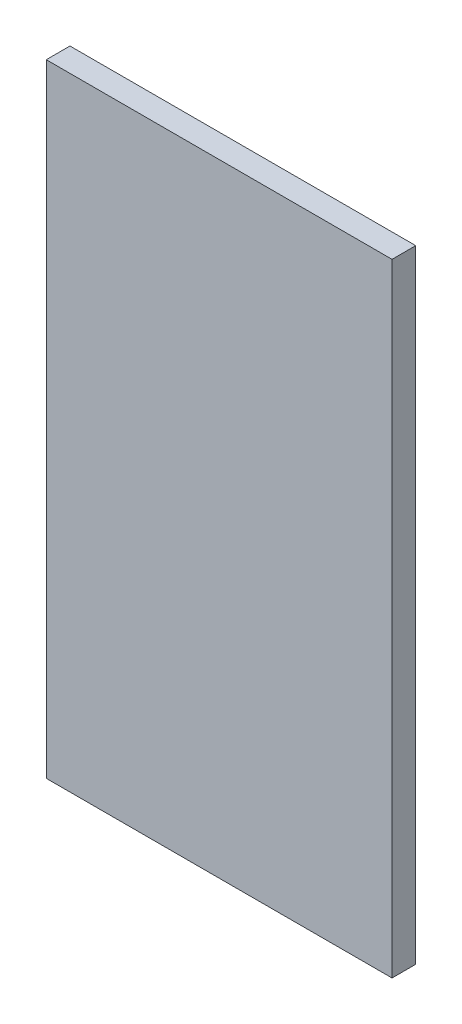
ISO-10303-21;
HEADER;
FILE_DESCRIPTION(('STEP AP214'),'2;1');
FILE_NAME('part.step','',(''),(''),'','','');
FILE_SCHEMA(('AUTOMOTIVE_DESIGN { 1 0 10303 214 1 1 1 1 }'));
ENDSEC;
DATA;
#1=APPLICATION_CONTEXT('core data for automotive mechanical design processes');
#2=APPLICATION_PROTOCOL_DEFINITION('international standard','automotive_design',2000,#1);
#3=PRODUCT_CONTEXT('',#1,'mechanical');
#4=PRODUCT('Part','Part','',(#3));
#5=PRODUCT_RELATED_PRODUCT_CATEGORY('part','',(#4));
#6=PRODUCT_DEFINITION_FORMATION('','',#4);
#7=PRODUCT_DEFINITION_CONTEXT('part definition',#1,'design');
#8=PRODUCT_DEFINITION('design','',#6,#7);
#9=PRODUCT_DEFINITION_SHAPE('','',#8);
#10=(LENGTH_UNIT() NAMED_UNIT(*) SI_UNIT(.MILLI.,.METRE.));
#11=(NAMED_UNIT(*) PLANE_ANGLE_UNIT() SI_UNIT($,.RADIAN.));
#12=(NAMED_UNIT(*) SI_UNIT($,.STERADIAN.) SOLID_ANGLE_UNIT());
#13=UNCERTAINTY_MEASURE_WITH_UNIT(LENGTH_MEASURE(1.E-05),#10,'distance_accuracy_value','');
#14=(GEOMETRIC_REPRESENTATION_CONTEXT(3) GLOBAL_UNCERTAINTY_ASSIGNED_CONTEXT((#13)) GLOBAL_UNIT_ASSIGNED_CONTEXT((#10,
#11,#12)) REPRESENTATION_CONTEXT('',''));
#15=CARTESIAN_POINT('',(0.,0.,0.));
#16=DIRECTION('',(0.,0.,1.));
#17=DIRECTION('',(1.,0.,0.));
#18=AXIS2_PLACEMENT_3D('',#15,#16,#17);
#19=CARTESIAN_POINT('',(5.80008,0.7,0.));
#20=DIRECTION('',(0.,0.,-1.));
#21=DIRECTION('',(-1.,0.,0.));
#22=AXIS2_PLACEMENT_3D('',#19,#20,#21);
#23=PLANE('',#22);
#24=DIRECTION('',(1.,0.,0.));
#25=VECTOR('',#24,1.);
#26=CARTESIAN_POINT('',(5.55008,1.15,0.));
#27=LINE('',#26,#25);
#28=CARTESIAN_POINT('',(5.55008,1.15,0.));
#29=VERTEX_POINT('',#28);
#30=CARTESIAN_POINT('',(6.05008,1.15,0.));
#31=VERTEX_POINT('',#30);
#32=EDGE_CURVE('E55',#29,#31,#27,.T.);
#33=ORIENTED_EDGE('',*,*,#32,.T.);
#34=DIRECTION('',(0.,1.,0.));
#35=VECTOR('',#34,1.);
#36=CARTESIAN_POINT('',(6.05008,1.15,0.));
#37=LINE('',#36,#35);
#38=CARTESIAN_POINT('',(6.05008,0.25,0.));
#39=VERTEX_POINT('',#38);
#40=EDGE_CURVE('E57',#31,#39,#37,.F.);
#41=ORIENTED_EDGE('',*,*,#40,.T.);
#42=DIRECTION('',(1.,0.,0.));
#43=VECTOR('',#42,1.);
#44=CARTESIAN_POINT('',(6.05008,0.25,0.));
#45=LINE('',#44,#43);
#46=CARTESIAN_POINT('',(5.55008,0.25,0.));
#47=VERTEX_POINT('',#46);
#48=EDGE_CURVE('E20',#39,#47,#45,.F.);
#49=ORIENTED_EDGE('',*,*,#48,.T.);
#50=DIRECTION('',(0.,1.,0.));
#51=VECTOR('',#50,1.);
#52=CARTESIAN_POINT('',(5.55008,0.25,0.));
#53=LINE('',#52,#51);
#54=EDGE_CURVE('E80',#47,#29,#53,.T.);
#55=ORIENTED_EDGE('',*,*,#54,.T.);
#56=EDGE_LOOP('',(#33,#41,#49,#55));
#57=FACE_BOUND('',#56,.T.);
#58=ADVANCED_FACE('F17',(#57),#23,.T.);
#59=CARTESIAN_POINT('',(6.05008,0.25,0.));
#60=DIRECTION('',(0.,1.,0.));
#61=DIRECTION('',(0.,0.,1.));
#62=AXIS2_PLACEMENT_3D('',#59,#60,#61);
#63=PLANE('',#62);
#64=DIRECTION('',(0.,0.,-1.));
#65=VECTOR('',#64,1.);
#66=CARTESIAN_POINT('',(5.55008,0.25,0.));
#67=LINE('',#66,#65);
#68=CARTESIAN_POINT('',(5.55008,0.25,0.03429));
#69=VERTEX_POINT('',#68);
#70=EDGE_CURVE('E68',#69,#47,#67,.T.);
#71=ORIENTED_EDGE('',*,*,#70,.T.);
#72=ORIENTED_EDGE('',*,*,#48,.F.);
#73=DIRECTION('',(0.,0.,1.));
#74=VECTOR('',#73,1.);
#75=CARTESIAN_POINT('',(6.05008,0.25,0.));
#76=LINE('',#75,#74);
#77=CARTESIAN_POINT('',(6.05008,0.25,0.03429));
#78=VERTEX_POINT('',#77);
#79=EDGE_CURVE('E63',#39,#78,#76,.T.);
#80=ORIENTED_EDGE('',*,*,#79,.T.);
#81=DIRECTION('',(1.,0.,0.));
#82=VECTOR('',#81,1.);
#83=CARTESIAN_POINT('',(5.80008,0.25,0.03429));
#84=LINE('',#83,#82);
#85=EDGE_CURVE('E83',#69,#78,#84,.T.);
#86=ORIENTED_EDGE('',*,*,#85,.F.);
#87=EDGE_LOOP('',(#71,#72,#80,#86));
#88=FACE_BOUND('',#87,.T.);
#89=ADVANCED_FACE('F65',(#88),#63,.F.);
#90=CARTESIAN_POINT('',(6.05008,1.15,0.));
#91=DIRECTION('',(-1.,0.,0.));
#92=DIRECTION('',(0.,0.,1.));
#93=AXIS2_PLACEMENT_3D('',#90,#91,#92);
#94=PLANE('',#93);
#95=ORIENTED_EDGE('',*,*,#79,.F.);
#96=ORIENTED_EDGE('',*,*,#40,.F.);
#97=DIRECTION('',(0.,0.,-1.));
#98=VECTOR('',#97,1.);
#99=CARTESIAN_POINT('',(6.05008,1.15,0.));
#100=LINE('',#99,#98);
#101=CARTESIAN_POINT('',(6.05008,1.15,0.03429));
#102=VERTEX_POINT('',#101);
#103=EDGE_CURVE('E75',#31,#102,#100,.F.);
#104=ORIENTED_EDGE('',*,*,#103,.T.);
#105=DIRECTION('',(0.,1.,0.));
#106=VECTOR('',#105,1.);
#107=CARTESIAN_POINT('',(6.05008,0.7,0.03429));
#108=LINE('',#107,#106);
#109=EDGE_CURVE('E72',#78,#102,#108,.T.);
#110=ORIENTED_EDGE('',*,*,#109,.F.);
#111=EDGE_LOOP('',(#95,#96,#104,#110));
#112=FACE_BOUND('',#111,.T.);
#113=ADVANCED_FACE('F70',(#112),#94,.F.);
#114=CARTESIAN_POINT('',(5.55008,1.15,0.));
#115=DIRECTION('',(0.,-1.,0.));
#116=DIRECTION('',(0.,0.,-1.));
#117=AXIS2_PLACEMENT_3D('',#114,#115,#116);
#118=PLANE('',#117);
#119=ORIENTED_EDGE('',*,*,#103,.F.);
#120=ORIENTED_EDGE('',*,*,#32,.F.);
#121=DIRECTION('',(0.,0.,-1.));
#122=VECTOR('',#121,1.);
#123=CARTESIAN_POINT('',(5.55008,1.15,0.));
#124=LINE('',#123,#122);
#125=CARTESIAN_POINT('',(5.55008,1.15,0.03429));
#126=VERTEX_POINT('',#125);
#127=EDGE_CURVE('E35',#29,#126,#124,.F.);
#128=ORIENTED_EDGE('',*,*,#127,.T.);
#129=DIRECTION('',(1.,0.,0.));
#130=VECTOR('',#129,1.);
#131=CARTESIAN_POINT('',(5.80008,1.15,0.03429));
#132=LINE('',#131,#130);
#133=EDGE_CURVE('E26',#102,#126,#132,.F.);
#134=ORIENTED_EDGE('',*,*,#133,.F.);
#135=EDGE_LOOP('',(#119,#120,#128,#134));
#136=FACE_BOUND('',#135,.T.);
#137=ADVANCED_FACE('F89',(#136),#118,.F.);
#138=CARTESIAN_POINT('',(5.55008,0.25,0.));
#139=DIRECTION('',(1.,0.,0.));
#140=DIRECTION('',(0.,0.,-1.));
#141=AXIS2_PLACEMENT_3D('',#138,#139,#140);
#142=PLANE('',#141);
#143=ORIENTED_EDGE('',*,*,#127,.F.);
#144=ORIENTED_EDGE('',*,*,#54,.F.);
#145=ORIENTED_EDGE('',*,*,#70,.F.);
#146=DIRECTION('',(0.,1.,0.));
#147=VECTOR('',#146,1.);
#148=CARTESIAN_POINT('',(5.55008,0.7,0.03429));
#149=LINE('',#148,#147);
#150=EDGE_CURVE('E11',#126,#69,#149,.F.);
#151=ORIENTED_EDGE('',*,*,#150,.F.);
#152=EDGE_LOOP('',(#143,#144,#145,#151));
#153=FACE_BOUND('',#152,.T.);
#154=ADVANCED_FACE('F91',(#153),#142,.F.);
#155=CARTESIAN_POINT('',(5.80008,0.7,0.03429));
#156=DIRECTION('',(0.,0.,1.));
#157=DIRECTION('',(1.,0.,0.));
#158=AXIS2_PLACEMENT_3D('',#155,#156,#157);
#159=PLANE('',#158);
#160=ORIENTED_EDGE('',*,*,#133,.T.);
#161=ORIENTED_EDGE('',*,*,#150,.T.);
#162=ORIENTED_EDGE('',*,*,#85,.T.);
#163=ORIENTED_EDGE('',*,*,#109,.T.);
#164=EDGE_LOOP('',(#160,#161,#162,#163));
#165=FACE_BOUND('',#164,.T.);
#166=ADVANCED_FACE('F88',(#165),#159,.T.);
#167=CLOSED_SHELL('',(#58,#89,#113,#137,#154,#166));
#168=MANIFOLD_SOLID_BREP('B1',#167);
#169=ADVANCED_BREP_SHAPE_REPRESENTATION('',(#18,#168),#14);
#170=SHAPE_DEFINITION_REPRESENTATION(#9,#169);
ENDSEC;
END-ISO-10303-21;
